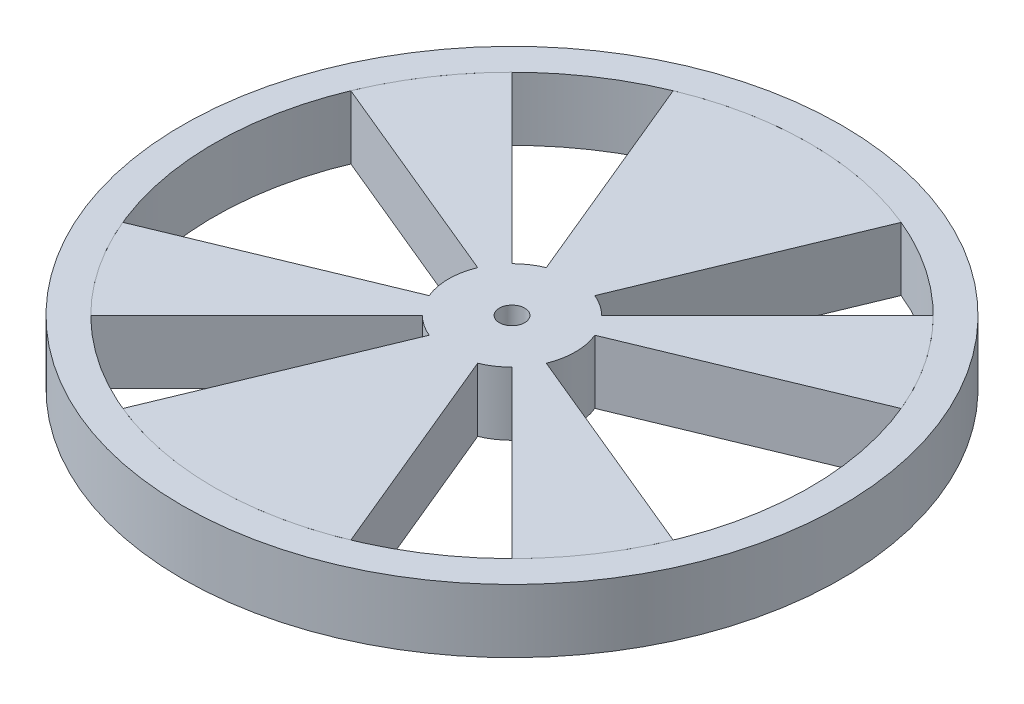
ISO-10303-21;
HEADER;
FILE_DESCRIPTION(('STEP AP214'),'2;1');
FILE_NAME('part.step','',(''),(''),'','','');
FILE_SCHEMA(('AUTOMOTIVE_DESIGN { 1 0 10303 214 1 1 1 1 }'));
ENDSEC;
DATA;
#1=APPLICATION_CONTEXT('core data for automotive mechanical design processes');
#2=APPLICATION_PROTOCOL_DEFINITION('international standard','automotive_design',2000,#1);
#3=PRODUCT_CONTEXT('',#1,'mechanical');
#4=PRODUCT('Part','Part','',(#3));
#5=PRODUCT_RELATED_PRODUCT_CATEGORY('part','',(#4));
#6=PRODUCT_DEFINITION_FORMATION('','',#4);
#7=PRODUCT_DEFINITION_CONTEXT('part definition',#1,'design');
#8=PRODUCT_DEFINITION('design','',#6,#7);
#9=PRODUCT_DEFINITION_SHAPE('','',#8);
#10=(LENGTH_UNIT() NAMED_UNIT(*) SI_UNIT(.MILLI.,.METRE.));
#11=(NAMED_UNIT(*) PLANE_ANGLE_UNIT() SI_UNIT($,.RADIAN.));
#12=(NAMED_UNIT(*) SI_UNIT($,.STERADIAN.) SOLID_ANGLE_UNIT());
#13=UNCERTAINTY_MEASURE_WITH_UNIT(LENGTH_MEASURE(1.E-05),#10,'distance_accuracy_value','');
#14=(GEOMETRIC_REPRESENTATION_CONTEXT(3) GLOBAL_UNCERTAINTY_ASSIGNED_CONTEXT((#13)) GLOBAL_UNIT_ASSIGNED_CONTEXT((#10,
#11,#12)) REPRESENTATION_CONTEXT('',''));
#15=CARTESIAN_POINT('',(0.,0.,0.));
#16=DIRECTION('',(0.,0.,1.));
#17=DIRECTION('',(1.,0.,0.));
#18=AXIS2_PLACEMENT_3D('',#15,#16,#17);
#19=CARTESIAN_POINT('',(0.,0.,0.));
#20=DIRECTION('',(0.,1.,0.));
#21=DIRECTION('',(0.,0.,1.));
#22=AXIS2_PLACEMENT_3D('',#19,#20,#21);
#23=CYLINDRICAL_SURFACE('',#22,23.5);
#24=CARTESIAN_POINT('',(0.,5.,0.));
#25=DIRECTION('',(0.,1.,0.));
#26=DIRECTION('',(0.,0.,1.));
#27=AXIS2_PLACEMENT_3D('',#24,#25,#26);
#28=CIRCLE('',#27,23.5);
#29=CARTESIAN_POINT('',(8.99306066057963,5.,-21.7111690140152));
#30=VERTEX_POINT('',#29);
#31=CARTESIAN_POINT('',(-8.99306066057962,5.,-21.7111690140152));
#32=VERTEX_POINT('',#31);
#33=EDGE_CURVE('E293',#30,#32,#28,.T.);
#34=ORIENTED_EDGE('',*,*,#33,.F.);
#35=DIRECTION('',(0.,1.,0.));
#36=VECTOR('',#35,1.);
#37=CARTESIAN_POINT('',(8.99306066057963,0.,-21.7111690140152));
#38=LINE('',#37,#36);
#39=CARTESIAN_POINT('',(8.99306066057963,0.,-21.7111690140152));
#40=VERTEX_POINT('',#39);
#41=EDGE_CURVE('E12',#40,#30,#38,.T.);
#42=ORIENTED_EDGE('',*,*,#41,.F.);
#43=CARTESIAN_POINT('',(0.,0.,0.));
#44=DIRECTION('',(0.,1.,0.));
#45=DIRECTION('',(0.,0.,1.));
#46=AXIS2_PLACEMENT_3D('',#43,#44,#45);
#47=CIRCLE('',#46,23.5);
#48=CARTESIAN_POINT('',(-8.99306066057962,0.,-21.7111690140152));
#49=VERTEX_POINT('',#48);
#50=EDGE_CURVE('E250',#40,#49,#47,.T.);
#51=ORIENTED_EDGE('',*,*,#50,.T.);
#52=DIRECTION('',(0.,1.,0.));
#53=VECTOR('',#52,1.);
#54=CARTESIAN_POINT('',(-8.99306066057962,0.,-21.7111690140152));
#55=LINE('',#54,#53);
#56=EDGE_CURVE('E48',#49,#32,#55,.T.);
#57=ORIENTED_EDGE('',*,*,#56,.T.);
#58=EDGE_LOOP('',(#34,#42,#51,#57));
#59=FACE_BOUND('',#58,.T.);
#60=ADVANCED_FACE('F45',(#59),#23,.T.);
#61=CARTESIAN_POINT('',(0.,0.,0.));
#62=DIRECTION('',(0.923879532511287,0.,0.382683432365091));
#63=DIRECTION('',(0.382683432365091,0.,-0.923879532511287));
#64=AXIS2_PLACEMENT_3D('',#61,#62,#63);
#65=PLANE('',#64);
#66=DIRECTION('',(0.382683432365091,0.,-0.923879532511287));
#67=VECTOR('',#66,1.);
#68=CARTESIAN_POINT('',(0.,5.,0.));
#69=LINE('',#68,#67);
#70=CARTESIAN_POINT('',(1.91341716182545,5.,-4.61939766255643));
#71=VERTEX_POINT('',#70);
#72=EDGE_CURVE('E350',#71,#30,#69,.T.);
#73=ORIENTED_EDGE('',*,*,#72,.F.);
#74=DIRECTION('',(0.,1.,0.));
#75=VECTOR('',#74,1.);
#76=CARTESIAN_POINT('',(1.91341716182545,0.,-4.61939766255643));
#77=LINE('',#76,#75);
#78=CARTESIAN_POINT('',(1.91341716182545,0.,-4.61939766255643));
#79=VERTEX_POINT('',#78);
#80=EDGE_CURVE('E54',#79,#71,#77,.T.);
#81=ORIENTED_EDGE('',*,*,#80,.F.);
#82=DIRECTION('',(0.382683432365091,0.,-0.923879532511287));
#83=VECTOR('',#82,1.);
#84=CARTESIAN_POINT('',(0.,0.,0.));
#85=LINE('',#84,#83);
#86=EDGE_CURVE('E232',#79,#40,#85,.T.);
#87=ORIENTED_EDGE('',*,*,#86,.T.);
#88=ORIENTED_EDGE('',*,*,#41,.T.);
#89=EDGE_LOOP('',(#73,#81,#87,#88));
#90=FACE_BOUND('',#89,.T.);
#91=ADVANCED_FACE('F401',(#90),#65,.T.);
#92=CARTESIAN_POINT('',(0.,0.,0.));
#93=DIRECTION('',(0.,1.,0.));
#94=DIRECTION('',(0.,0.,1.));
#95=AXIS2_PLACEMENT_3D('',#92,#93,#94);
#96=CYLINDRICAL_SURFACE('',#95,5.);
#97=CARTESIAN_POINT('',(0.,5.,0.));
#98=DIRECTION('',(0.,1.,0.));
#99=DIRECTION('',(0.,0.,1.));
#100=AXIS2_PLACEMENT_3D('',#97,#98,#99);
#101=CIRCLE('',#100,5.);
#102=CARTESIAN_POINT('',(3.53553390593273,5.,-3.53553390593274));
#103=VERTEX_POINT('',#102);
#104=EDGE_CURVE('E217',#103,#71,#101,.T.);
#105=ORIENTED_EDGE('',*,*,#104,.F.);
#106=DIRECTION('',(0.,1.,0.));
#107=VECTOR('',#106,1.);
#108=CARTESIAN_POINT('',(3.53553390593273,0.,-3.53553390593274));
#109=LINE('',#108,#107);
#110=CARTESIAN_POINT('',(3.53553390593273,0.,-3.53553390593274));
#111=VERTEX_POINT('',#110);
#112=EDGE_CURVE('E211',#111,#103,#109,.T.);
#113=ORIENTED_EDGE('',*,*,#112,.F.);
#114=CARTESIAN_POINT('',(0.,0.,0.));
#115=DIRECTION('',(0.,1.,0.));
#116=DIRECTION('',(0.,0.,1.));
#117=AXIS2_PLACEMENT_3D('',#114,#115,#116);
#118=CIRCLE('',#117,5.);
#119=EDGE_CURVE('E215',#111,#79,#118,.T.);
#120=ORIENTED_EDGE('',*,*,#119,.T.);
#121=ORIENTED_EDGE('',*,*,#80,.T.);
#122=EDGE_LOOP('',(#105,#113,#120,#121));
#123=FACE_BOUND('',#122,.T.);
#124=ADVANCED_FACE('F213',(#123),#96,.T.);
#125=CARTESIAN_POINT('',(0.,0.,0.));
#126=DIRECTION('',(0.707106781186549,0.,0.707106781186546));
#127=DIRECTION('',(0.707106781186546,0.,-0.707106781186549));
#128=AXIS2_PLACEMENT_3D('',#125,#126,#127);
#129=PLANE('',#128);
#130=DIRECTION('',(0.707106781186546,0.,-0.707106781186549));
#131=VECTOR('',#130,1.);
#132=CARTESIAN_POINT('',(0.,5.,0.));
#133=LINE('',#132,#131);
#134=CARTESIAN_POINT('',(16.6170093578838,5.,-16.6170093578839));
#135=VERTEX_POINT('',#134);
#136=EDGE_CURVE('E348',#103,#135,#133,.T.);
#137=ORIENTED_EDGE('',*,*,#136,.T.);
#138=DIRECTION('',(0.,1.,0.));
#139=VECTOR('',#138,1.);
#140=CARTESIAN_POINT('',(16.6170093578838,0.,-16.6170093578839));
#141=LINE('',#140,#139);
#142=CARTESIAN_POINT('',(16.6170093578838,0.,-16.6170093578839));
#143=VERTEX_POINT('',#142);
#144=EDGE_CURVE('E221',#143,#135,#141,.T.);
#145=ORIENTED_EDGE('',*,*,#144,.F.);
#146=DIRECTION('',(0.707106781186546,0.,-0.707106781186549));
#147=VECTOR('',#146,1.);
#148=CARTESIAN_POINT('',(0.,0.,0.));
#149=LINE('',#148,#147);
#150=EDGE_CURVE('E224',#111,#143,#149,.T.);
#151=ORIENTED_EDGE('',*,*,#150,.F.);
#152=ORIENTED_EDGE('',*,*,#112,.T.);
#153=EDGE_LOOP('',(#137,#145,#151,#152));
#154=FACE_BOUND('',#153,.T.);
#155=ADVANCED_FACE('F225',(#154),#129,.F.);
#156=CARTESIAN_POINT('',(0.,0.,0.));
#157=DIRECTION('',(0.,1.,0.));
#158=DIRECTION('',(0.,0.,1.));
#159=AXIS2_PLACEMENT_3D('',#156,#157,#158);
#160=CYLINDRICAL_SURFACE('',#159,23.5);
#161=CARTESIAN_POINT('',(0.,5.,0.));
#162=DIRECTION('',(0.,1.,0.));
#163=DIRECTION('',(0.,0.,1.));
#164=AXIS2_PLACEMENT_3D('',#161,#162,#163);
#165=CIRCLE('',#164,23.5);
#166=CARTESIAN_POINT('',(21.7111690140152,5.,-8.99306066057963));
#167=VERTEX_POINT('',#166);
#168=EDGE_CURVE('E345',#167,#135,#165,.T.);
#169=ORIENTED_EDGE('',*,*,#168,.F.);
#170=DIRECTION('',(0.,1.,0.));
#171=VECTOR('',#170,1.);
#172=CARTESIAN_POINT('',(21.7111690140152,0.,-8.99306066057963));
#173=LINE('',#172,#171);
#174=CARTESIAN_POINT('',(21.7111690140152,0.,-8.99306066057963));
#175=VERTEX_POINT('',#174);
#176=EDGE_CURVE('E358',#175,#167,#173,.T.);
#177=ORIENTED_EDGE('',*,*,#176,.F.);
#178=CARTESIAN_POINT('',(0.,0.,0.));
#179=DIRECTION('',(0.,1.,0.));
#180=DIRECTION('',(0.,0.,1.));
#181=AXIS2_PLACEMENT_3D('',#178,#179,#180);
#182=CIRCLE('',#181,23.5);
#183=EDGE_CURVE('E228',#175,#143,#182,.T.);
#184=ORIENTED_EDGE('',*,*,#183,.T.);
#185=ORIENTED_EDGE('',*,*,#144,.T.);
#186=EDGE_LOOP('',(#169,#177,#184,#185));
#187=FACE_BOUND('',#186,.T.);
#188=ADVANCED_FACE('F417',(#187),#160,.T.);
#189=CARTESIAN_POINT('',(0.,0.,0.));
#190=DIRECTION('',(0.382683432365091,0.,0.923879532511287));
#191=DIRECTION('',(0.923879532511287,0.,-0.382683432365091));
#192=AXIS2_PLACEMENT_3D('',#189,#190,#191);
#193=PLANE('',#192);
#194=DIRECTION('',(0.923879532511286,0.,-0.382683432365091));
#195=VECTOR('',#194,1.);
#196=CARTESIAN_POINT('',(0.,5.,0.));
#197=LINE('',#196,#195);
#198=CARTESIAN_POINT('',(4.61939766255643,5.,-1.91341716182545));
#199=VERTEX_POINT('',#198);
#200=EDGE_CURVE('E342',#199,#167,#197,.T.);
#201=ORIENTED_EDGE('',*,*,#200,.F.);
#202=DIRECTION('',(0.,1.,0.));
#203=VECTOR('',#202,1.);
#204=CARTESIAN_POINT('',(4.61939766255643,0.,-1.91341716182545));
#205=LINE('',#204,#203);
#206=CARTESIAN_POINT('',(4.61939766255643,0.,-1.91341716182545));
#207=VERTEX_POINT('',#206);
#208=EDGE_CURVE('E360',#207,#199,#205,.T.);
#209=ORIENTED_EDGE('',*,*,#208,.F.);
#210=DIRECTION('',(0.923879532511286,0.,-0.382683432365091));
#211=VECTOR('',#210,1.);
#212=CARTESIAN_POINT('',(0.,0.,0.));
#213=LINE('',#212,#211);
#214=EDGE_CURVE('E241',#207,#175,#213,.T.);
#215=ORIENTED_EDGE('',*,*,#214,.T.);
#216=ORIENTED_EDGE('',*,*,#176,.T.);
#217=EDGE_LOOP('',(#201,#209,#215,#216));
#218=FACE_BOUND('',#217,.T.);
#219=ADVANCED_FACE('F420',(#218),#193,.T.);
#220=CARTESIAN_POINT('',(4.61939766255643,5.,1.91341716182545));
#221=VERTEX_POINT('',#220);
#222=EDGE_CURVE('E341',#221,#199,#101,.T.);
#223=ORIENTED_EDGE('',*,*,#222,.F.);
#224=DIRECTION('',(0.,1.,0.));
#225=VECTOR('',#224,1.);
#226=CARTESIAN_POINT('',(4.61939766255643,0.,1.91341716182545));
#227=LINE('',#226,#225);
#228=CARTESIAN_POINT('',(4.61939766255643,0.,1.91341716182545));
#229=VERTEX_POINT('',#228);
#230=EDGE_CURVE('E362',#229,#221,#227,.T.);
#231=ORIENTED_EDGE('',*,*,#230,.F.);
#232=EDGE_CURVE('E234',#229,#207,#118,.T.);
#233=ORIENTED_EDGE('',*,*,#232,.T.);
#234=ORIENTED_EDGE('',*,*,#208,.T.);
#235=EDGE_LOOP('',(#223,#231,#233,#234));
#236=FACE_BOUND('',#235,.T.);
#237=ADVANCED_FACE('F410',(#236),#96,.T.);
#238=CARTESIAN_POINT('',(0.,0.,0.));
#239=DIRECTION('',(-0.382683432365091,0.,0.923879532511286));
#240=DIRECTION('',(0.923879532511286,0.,0.382683432365091));
#241=AXIS2_PLACEMENT_3D('',#238,#239,#240);
#242=PLANE('',#241);
#243=DIRECTION('',(0.923879532511286,0.,0.382683432365091));
#244=VECTOR('',#243,1.);
#245=CARTESIAN_POINT('',(0.,5.,0.));
#246=LINE('',#245,#244);
#247=CARTESIAN_POINT('',(21.7111690140152,5.,8.99306066057964));
#248=VERTEX_POINT('',#247);
#249=EDGE_CURVE('E338',#221,#248,#246,.T.);
#250=ORIENTED_EDGE('',*,*,#249,.T.);
#251=DIRECTION('',(0.,1.,0.));
#252=VECTOR('',#251,1.);
#253=CARTESIAN_POINT('',(21.7111690140152,0.,8.99306066057964));
#254=LINE('',#253,#252);
#255=CARTESIAN_POINT('',(21.7111690140152,0.,8.99306066057964));
#256=VERTEX_POINT('',#255);
#257=EDGE_CURVE('E364',#256,#248,#254,.T.);
#258=ORIENTED_EDGE('',*,*,#257,.F.);
#259=DIRECTION('',(0.923879532511286,0.,0.382683432365091));
#260=VECTOR('',#259,1.);
#261=CARTESIAN_POINT('',(0.,0.,0.));
#262=LINE('',#261,#260);
#263=EDGE_CURVE('E242',#229,#256,#262,.T.);
#264=ORIENTED_EDGE('',*,*,#263,.F.);
#265=ORIENTED_EDGE('',*,*,#230,.T.);
#266=EDGE_LOOP('',(#250,#258,#264,#265));
#267=FACE_BOUND('',#266,.T.);
#268=ADVANCED_FACE('F425',(#267),#242,.F.);
#269=CARTESIAN_POINT('',(0.,0.,0.));
#270=DIRECTION('',(0.,1.,0.));
#271=DIRECTION('',(0.,0.,1.));
#272=AXIS2_PLACEMENT_3D('',#269,#270,#271);
#273=CYLINDRICAL_SURFACE('',#272,23.5);
#274=CARTESIAN_POINT('',(0.,5.,0.));
#275=DIRECTION('',(0.,1.,0.));
#276=DIRECTION('',(0.,0.,1.));
#277=AXIS2_PLACEMENT_3D('',#274,#275,#276);
#278=CIRCLE('',#277,23.5);
#279=CARTESIAN_POINT('',(16.6170093578839,5.,16.6170093578839));
#280=VERTEX_POINT('',#279);
#281=EDGE_CURVE('E335',#280,#248,#278,.T.);
#282=ORIENTED_EDGE('',*,*,#281,.F.);
#283=DIRECTION('',(0.,1.,0.));
#284=VECTOR('',#283,1.);
#285=CARTESIAN_POINT('',(16.6170093578839,0.,16.6170093578839));
#286=LINE('',#285,#284);
#287=CARTESIAN_POINT('',(16.6170093578839,0.,16.6170093578839));
#288=VERTEX_POINT('',#287);
#289=EDGE_CURVE('E366',#288,#280,#286,.T.);
#290=ORIENTED_EDGE('',*,*,#289,.F.);
#291=CARTESIAN_POINT('',(0.,0.,0.));
#292=DIRECTION('',(0.,1.,0.));
#293=DIRECTION('',(0.,0.,1.));
#294=AXIS2_PLACEMENT_3D('',#291,#292,#293);
#295=CIRCLE('',#294,23.5);
#296=EDGE_CURVE('E276',#288,#256,#295,.T.);
#297=ORIENTED_EDGE('',*,*,#296,.T.);
#298=ORIENTED_EDGE('',*,*,#257,.T.);
#299=EDGE_LOOP('',(#282,#290,#297,#298));
#300=FACE_BOUND('',#299,.T.);
#301=ADVANCED_FACE('F428',(#300),#273,.T.);
#302=CARTESIAN_POINT('',(0.,0.,0.));
#303=DIRECTION('',(-0.707106781186548,0.,0.707106781186548));
#304=DIRECTION('',(0.707106781186548,0.,0.707106781186548));
#305=AXIS2_PLACEMENT_3D('',#302,#303,#304);
#306=PLANE('',#305);
#307=DIRECTION('',(0.707106781186548,0.,0.707106781186548));
#308=VECTOR('',#307,1.);
#309=CARTESIAN_POINT('',(0.,5.,0.));
#310=LINE('',#309,#308);
#311=CARTESIAN_POINT('',(3.53553390593274,5.,3.53553390593274));
#312=VERTEX_POINT('',#311);
#313=EDGE_CURVE('E332',#312,#280,#310,.T.);
#314=ORIENTED_EDGE('',*,*,#313,.F.);
#315=DIRECTION('',(0.,1.,0.));
#316=VECTOR('',#315,1.);
#317=CARTESIAN_POINT('',(3.53553390593274,0.,3.53553390593274));
#318=LINE('',#317,#316);
#319=CARTESIAN_POINT('',(3.53553390593274,0.,3.53553390593274));
#320=VERTEX_POINT('',#319);
#321=EDGE_CURVE('E368',#320,#312,#318,.T.);
#322=ORIENTED_EDGE('',*,*,#321,.F.);
#323=DIRECTION('',(0.707106781186548,0.,0.707106781186548));
#324=VECTOR('',#323,1.);
#325=CARTESIAN_POINT('',(0.,0.,0.));
#326=LINE('',#325,#324);
#327=EDGE_CURVE('E271',#320,#288,#326,.T.);
#328=ORIENTED_EDGE('',*,*,#327,.T.);
#329=ORIENTED_EDGE('',*,*,#289,.T.);
#330=EDGE_LOOP('',(#314,#322,#328,#329));
#331=FACE_BOUND('',#330,.T.);
#332=ADVANCED_FACE('F432',(#331),#306,.T.);
#333=CARTESIAN_POINT('',(1.91341716182545,5.,4.61939766255643));
#334=VERTEX_POINT('',#333);
#335=EDGE_CURVE('E331',#334,#312,#101,.T.);
#336=ORIENTED_EDGE('',*,*,#335,.F.);
#337=DIRECTION('',(0.,1.,0.));
#338=VECTOR('',#337,1.);
#339=CARTESIAN_POINT('',(1.91341716182545,0.,4.61939766255643));
#340=LINE('',#339,#338);
#341=CARTESIAN_POINT('',(1.91341716182545,0.,4.61939766255643));
#342=VERTEX_POINT('',#341);
#343=EDGE_CURVE('E370',#342,#334,#340,.T.);
#344=ORIENTED_EDGE('',*,*,#343,.F.);
#345=EDGE_CURVE('E243',#342,#320,#118,.T.);
#346=ORIENTED_EDGE('',*,*,#345,.T.);
#347=ORIENTED_EDGE('',*,*,#321,.T.);
#348=EDGE_LOOP('',(#336,#344,#346,#347));
#349=FACE_BOUND('',#348,.T.);
#350=ADVANCED_FACE('F436',(#349),#96,.T.);
#351=CARTESIAN_POINT('',(0.,0.,0.));
#352=DIRECTION('',(-0.923879532511287,0.,0.382683432365091));
#353=DIRECTION('',(0.382683432365091,0.,0.923879532511287));
#354=AXIS2_PLACEMENT_3D('',#351,#352,#353);
#355=PLANE('',#354);
#356=DIRECTION('',(0.382683432365091,0.,0.923879532511287));
#357=VECTOR('',#356,1.);
#358=CARTESIAN_POINT('',(0.,5.,0.));
#359=LINE('',#358,#357);
#360=CARTESIAN_POINT('',(8.99306066057963,5.,21.7111690140152));
#361=VERTEX_POINT('',#360);
#362=EDGE_CURVE('E328',#334,#361,#359,.T.);
#363=ORIENTED_EDGE('',*,*,#362,.T.);
#364=DIRECTION('',(0.,1.,0.));
#365=VECTOR('',#364,1.);
#366=CARTESIAN_POINT('',(8.99306066057963,0.,21.7111690140152));
#367=LINE('',#366,#365);
#368=CARTESIAN_POINT('',(8.99306066057963,0.,21.7111690140152));
#369=VERTEX_POINT('',#368);
#370=EDGE_CURVE('E372',#369,#361,#367,.T.);
#371=ORIENTED_EDGE('',*,*,#370,.F.);
#372=DIRECTION('',(0.382683432365091,0.,0.923879532511287));
#373=VECTOR('',#372,1.);
#374=CARTESIAN_POINT('',(0.,0.,0.));
#375=LINE('',#374,#373);
#376=EDGE_CURVE('E272',#342,#369,#375,.T.);
#377=ORIENTED_EDGE('',*,*,#376,.F.);
#378=ORIENTED_EDGE('',*,*,#343,.T.);
#379=EDGE_LOOP('',(#363,#371,#377,#378));
#380=FACE_BOUND('',#379,.T.);
#381=ADVANCED_FACE('F438',(#380),#355,.F.);
#382=CARTESIAN_POINT('',(0.,0.,0.));
#383=DIRECTION('',(0.,1.,0.));
#384=DIRECTION('',(0.,0.,1.));
#385=AXIS2_PLACEMENT_3D('',#382,#383,#384);
#386=CYLINDRICAL_SURFACE('',#385,23.5);
#387=CARTESIAN_POINT('',(0.,5.,0.));
#388=DIRECTION('',(0.,1.,0.));
#389=DIRECTION('',(0.,0.,1.));
#390=AXIS2_PLACEMENT_3D('',#387,#388,#389);
#391=CIRCLE('',#390,23.5);
#392=CARTESIAN_POINT('',(-8.99306066057963,5.,21.7111690140152));
#393=VERTEX_POINT('',#392);
#394=EDGE_CURVE('E325',#393,#361,#391,.T.);
#395=ORIENTED_EDGE('',*,*,#394,.F.);
#396=DIRECTION('',(0.,1.,0.));
#397=VECTOR('',#396,1.);
#398=CARTESIAN_POINT('',(-8.99306066057963,0.,21.7111690140152));
#399=LINE('',#398,#397);
#400=CARTESIAN_POINT('',(-8.99306066057963,0.,21.7111690140152));
#401=VERTEX_POINT('',#400);
#402=EDGE_CURVE('E374',#401,#393,#399,.T.);
#403=ORIENTED_EDGE('',*,*,#402,.F.);
#404=CARTESIAN_POINT('',(0.,0.,0.));
#405=DIRECTION('',(0.,1.,0.));
#406=DIRECTION('',(0.,0.,1.));
#407=AXIS2_PLACEMENT_3D('',#404,#405,#406);
#408=CIRCLE('',#407,23.5);
#409=EDGE_CURVE('E267',#401,#369,#408,.T.);
#410=ORIENTED_EDGE('',*,*,#409,.T.);
#411=ORIENTED_EDGE('',*,*,#370,.T.);
#412=EDGE_LOOP('',(#395,#403,#410,#411));
#413=FACE_BOUND('',#412,.T.);
#414=ADVANCED_FACE('F441',(#413),#386,.T.);
#415=CARTESIAN_POINT('',(0.,0.,0.));
#416=DIRECTION('',(-0.923879532511287,0.,-0.382683432365091));
#417=DIRECTION('',(-0.382683432365091,0.,0.923879532511287));
#418=AXIS2_PLACEMENT_3D('',#415,#416,#417);
#419=PLANE('',#418);
#420=DIRECTION('',(-0.382683432365091,0.,0.923879532511287));
#421=VECTOR('',#420,1.);
#422=CARTESIAN_POINT('',(0.,5.,0.));
#423=LINE('',#422,#421);
#424=CARTESIAN_POINT('',(-1.91341716182545,5.,4.61939766255643));
#425=VERTEX_POINT('',#424);
#426=EDGE_CURVE('E322',#425,#393,#423,.T.);
#427=ORIENTED_EDGE('',*,*,#426,.F.);
#428=DIRECTION('',(0.,1.,0.));
#429=VECTOR('',#428,1.);
#430=CARTESIAN_POINT('',(-1.91341716182545,0.,4.61939766255643));
#431=LINE('',#430,#429);
#432=CARTESIAN_POINT('',(-1.91341716182545,0.,4.61939766255643));
#433=VERTEX_POINT('',#432);
#434=EDGE_CURVE('E376',#433,#425,#431,.T.);
#435=ORIENTED_EDGE('',*,*,#434,.F.);
#436=DIRECTION('',(-0.382683432365091,0.,0.923879532511287));
#437=VECTOR('',#436,1.);
#438=CARTESIAN_POINT('',(0.,0.,0.));
#439=LINE('',#438,#437);
#440=EDGE_CURVE('E262',#433,#401,#439,.T.);
#441=ORIENTED_EDGE('',*,*,#440,.T.);
#442=ORIENTED_EDGE('',*,*,#402,.T.);
#443=EDGE_LOOP('',(#427,#435,#441,#442));
#444=FACE_BOUND('',#443,.T.);
#445=ADVANCED_FACE('F445',(#444),#419,.T.);
#446=CARTESIAN_POINT('',(-3.53553390593274,5.,3.53553390593274));
#447=VERTEX_POINT('',#446);
#448=EDGE_CURVE('E321',#447,#425,#101,.T.);
#449=ORIENTED_EDGE('',*,*,#448,.F.);
#450=DIRECTION('',(0.,1.,0.));
#451=VECTOR('',#450,1.);
#452=CARTESIAN_POINT('',(-3.53553390593274,0.,3.53553390593274));
#453=LINE('',#452,#451);
#454=CARTESIAN_POINT('',(-3.53553390593274,0.,3.53553390593274));
#455=VERTEX_POINT('',#454);
#456=EDGE_CURVE('E378',#455,#447,#453,.T.);
#457=ORIENTED_EDGE('',*,*,#456,.F.);
#458=EDGE_CURVE('E254',#455,#433,#118,.T.);
#459=ORIENTED_EDGE('',*,*,#458,.T.);
#460=ORIENTED_EDGE('',*,*,#434,.T.);
#461=EDGE_LOOP('',(#449,#457,#459,#460));
#462=FACE_BOUND('',#461,.T.);
#463=ADVANCED_FACE('F449',(#462),#96,.T.);
#464=CARTESIAN_POINT('',(0.,0.,0.));
#465=DIRECTION('',(-0.707106781186548,0.,-0.707106781186548));
#466=DIRECTION('',(-0.707106781186548,0.,0.707106781186548));
#467=AXIS2_PLACEMENT_3D('',#464,#465,#466);
#468=PLANE('',#467);
#469=DIRECTION('',(-0.707106781186548,0.,0.707106781186548));
#470=VECTOR('',#469,1.);
#471=CARTESIAN_POINT('',(0.,5.,0.));
#472=LINE('',#471,#470);
#473=CARTESIAN_POINT('',(-16.6170093578839,5.,16.6170093578839));
#474=VERTEX_POINT('',#473);
#475=EDGE_CURVE('E318',#447,#474,#472,.T.);
#476=ORIENTED_EDGE('',*,*,#475,.T.);
#477=DIRECTION('',(0.,1.,0.));
#478=VECTOR('',#477,1.);
#479=CARTESIAN_POINT('',(-16.6170093578839,0.,16.6170093578839));
#480=LINE('',#479,#478);
#481=CARTESIAN_POINT('',(-16.6170093578839,0.,16.6170093578839));
#482=VERTEX_POINT('',#481);
#483=EDGE_CURVE('E380',#482,#474,#480,.T.);
#484=ORIENTED_EDGE('',*,*,#483,.F.);
#485=DIRECTION('',(-0.707106781186548,0.,0.707106781186548));
#486=VECTOR('',#485,1.);
#487=CARTESIAN_POINT('',(0.,0.,0.));
#488=LINE('',#487,#486);
#489=EDGE_CURVE('E263',#455,#482,#488,.T.);
#490=ORIENTED_EDGE('',*,*,#489,.F.);
#491=ORIENTED_EDGE('',*,*,#456,.T.);
#492=EDGE_LOOP('',(#476,#484,#490,#491));
#493=FACE_BOUND('',#492,.T.);
#494=ADVANCED_FACE('F451',(#493),#468,.F.);
#495=CARTESIAN_POINT('',(0.,0.,0.));
#496=DIRECTION('',(0.,1.,0.));
#497=DIRECTION('',(0.,0.,1.));
#498=AXIS2_PLACEMENT_3D('',#495,#496,#497);
#499=CYLINDRICAL_SURFACE('',#498,23.5);
#500=CARTESIAN_POINT('',(0.,5.,0.));
#501=DIRECTION('',(0.,1.,0.));
#502=DIRECTION('',(0.,0.,1.));
#503=AXIS2_PLACEMENT_3D('',#500,#501,#502);
#504=CIRCLE('',#503,23.5);
#505=CARTESIAN_POINT('',(-21.7111690140153,5.,8.99306066057955));
#506=VERTEX_POINT('',#505);
#507=EDGE_CURVE('E315',#506,#474,#504,.T.);
#508=ORIENTED_EDGE('',*,*,#507,.F.);
#509=DIRECTION('',(0.,1.,0.));
#510=VECTOR('',#509,1.);
#511=CARTESIAN_POINT('',(-21.7111690140153,0.,8.99306066057955));
#512=LINE('',#511,#510);
#513=CARTESIAN_POINT('',(-21.7111690140153,0.,8.99306066057955));
#514=VERTEX_POINT('',#513);
#515=EDGE_CURVE('E382',#514,#506,#512,.T.);
#516=ORIENTED_EDGE('',*,*,#515,.F.);
#517=CARTESIAN_POINT('',(0.,0.,0.));
#518=DIRECTION('',(0.,1.,0.));
#519=DIRECTION('',(0.,0.,1.));
#520=AXIS2_PLACEMENT_3D('',#517,#518,#519);
#521=CIRCLE('',#520,23.5);
#522=EDGE_CURVE('E258',#514,#482,#521,.T.);
#523=ORIENTED_EDGE('',*,*,#522,.T.);
#524=ORIENTED_EDGE('',*,*,#483,.T.);
#525=EDGE_LOOP('',(#508,#516,#523,#524));
#526=FACE_BOUND('',#525,.T.);
#527=ADVANCED_FACE('F454',(#526),#499,.T.);
#528=CARTESIAN_POINT('',(0.,0.,0.));
#529=DIRECTION('',(-0.382683432365087,0.,-0.923879532511288));
#530=DIRECTION('',(-0.923879532511288,0.,0.382683432365087));
#531=AXIS2_PLACEMENT_3D('',#528,#529,#530);
#532=PLANE('',#531);
#533=DIRECTION('',(-0.923879532511288,0.,0.382683432365087));
#534=VECTOR('',#533,1.);
#535=CARTESIAN_POINT('',(0.,5.,0.));
#536=LINE('',#535,#534);
#537=CARTESIAN_POINT('',(-4.61939766255644,5.,1.91341716182544));
#538=VERTEX_POINT('',#537);
#539=EDGE_CURVE('E312',#538,#506,#536,.T.);
#540=ORIENTED_EDGE('',*,*,#539,.F.);
#541=DIRECTION('',(0.,1.,0.));
#542=VECTOR('',#541,1.);
#543=CARTESIAN_POINT('',(-4.61939766255644,0.,1.91341716182544));
#544=LINE('',#543,#542);
#545=CARTESIAN_POINT('',(-4.61939766255644,0.,1.91341716182544));
#546=VERTEX_POINT('',#545);
#547=EDGE_CURVE('E384',#546,#538,#544,.T.);
#548=ORIENTED_EDGE('',*,*,#547,.F.);
#549=DIRECTION('',(-0.923879532511288,0.,0.382683432365087));
#550=VECTOR('',#549,1.);
#551=CARTESIAN_POINT('',(0.,0.,0.));
#552=LINE('',#551,#550);
#553=EDGE_CURVE('E252',#546,#514,#552,.T.);
#554=ORIENTED_EDGE('',*,*,#553,.T.);
#555=ORIENTED_EDGE('',*,*,#515,.T.);
#556=EDGE_LOOP('',(#540,#548,#554,#555));
#557=FACE_BOUND('',#556,.T.);
#558=ADVANCED_FACE('F458',(#557),#532,.T.);
#559=CARTESIAN_POINT('',(-4.61939766255644,5.,-1.91341716182544));
#560=VERTEX_POINT('',#559);
#561=EDGE_CURVE('E303',#560,#538,#101,.T.);
#562=ORIENTED_EDGE('',*,*,#561,.F.);
#563=DIRECTION('',(0.,1.,0.));
#564=VECTOR('',#563,1.);
#565=CARTESIAN_POINT('',(-4.61939766255644,0.,-1.91341716182544));
#566=LINE('',#565,#564);
#567=CARTESIAN_POINT('',(-4.61939766255644,0.,-1.91341716182544));
#568=VERTEX_POINT('',#567);
#569=EDGE_CURVE('E386',#568,#560,#566,.T.);
#570=ORIENTED_EDGE('',*,*,#569,.F.);
#571=EDGE_CURVE('E246',#568,#546,#118,.T.);
#572=ORIENTED_EDGE('',*,*,#571,.T.);
#573=ORIENTED_EDGE('',*,*,#547,.T.);
#574=EDGE_LOOP('',(#562,#570,#572,#573));
#575=FACE_BOUND('',#574,.T.);
#576=ADVANCED_FACE('F462',(#575),#96,.T.);
#577=CARTESIAN_POINT('',(0.,0.,0.));
#578=DIRECTION('',(0.382683432365087,0.,-0.923879532511288));
#579=DIRECTION('',(-0.923879532511288,0.,-0.382683432365087));
#580=AXIS2_PLACEMENT_3D('',#577,#578,#579);
#581=PLANE('',#580);
#582=DIRECTION('',(-0.923879532511288,0.,-0.382683432365087));
#583=VECTOR('',#582,1.);
#584=CARTESIAN_POINT('',(0.,5.,0.));
#585=LINE('',#584,#583);
#586=CARTESIAN_POINT('',(-21.7111690140153,5.,-8.99306066057956));
#587=VERTEX_POINT('',#586);
#588=EDGE_CURVE('E309',#560,#587,#585,.T.);
#589=ORIENTED_EDGE('',*,*,#588,.T.);
#590=DIRECTION('',(0.,1.,0.));
#591=VECTOR('',#590,1.);
#592=CARTESIAN_POINT('',(-21.7111690140153,0.,-8.99306066057956));
#593=LINE('',#592,#591);
#594=CARTESIAN_POINT('',(-21.7111690140153,0.,-8.99306066057956));
#595=VERTEX_POINT('',#594);
#596=EDGE_CURVE('E388',#595,#587,#593,.T.);
#597=ORIENTED_EDGE('',*,*,#596,.F.);
#598=DIRECTION('',(-0.923879532511288,0.,-0.382683432365087));
#599=VECTOR('',#598,1.);
#600=CARTESIAN_POINT('',(0.,0.,0.));
#601=LINE('',#600,#599);
#602=EDGE_CURVE('E253',#568,#595,#601,.T.);
#603=ORIENTED_EDGE('',*,*,#602,.F.);
#604=ORIENTED_EDGE('',*,*,#569,.T.);
#605=EDGE_LOOP('',(#589,#597,#603,#604));
#606=FACE_BOUND('',#605,.T.);
#607=ADVANCED_FACE('F464',(#606),#581,.F.);
#608=CARTESIAN_POINT('',(0.,0.,0.));
#609=DIRECTION('',(0.,1.,0.));
#610=DIRECTION('',(0.,0.,1.));
#611=AXIS2_PLACEMENT_3D('',#608,#609,#610);
#612=CYLINDRICAL_SURFACE('',#611,23.5);
#613=CARTESIAN_POINT('',(0.,5.,0.));
#614=DIRECTION('',(0.,1.,0.));
#615=DIRECTION('',(0.,0.,1.));
#616=AXIS2_PLACEMENT_3D('',#613,#614,#615);
#617=CIRCLE('',#616,23.5);
#618=CARTESIAN_POINT('',(-16.6170093578839,5.,-16.6170093578838));
#619=VERTEX_POINT('',#618);
#620=EDGE_CURVE('E306',#619,#587,#617,.T.);
#621=ORIENTED_EDGE('',*,*,#620,.F.);
#622=DIRECTION('',(0.,1.,0.));
#623=VECTOR('',#622,1.);
#624=CARTESIAN_POINT('',(-16.6170093578839,0.,-16.6170093578838));
#625=LINE('',#624,#623);
#626=CARTESIAN_POINT('',(-16.6170093578839,0.,-16.6170093578838));
#627=VERTEX_POINT('',#626);
#628=EDGE_CURVE('E390',#627,#619,#625,.T.);
#629=ORIENTED_EDGE('',*,*,#628,.F.);
#630=CARTESIAN_POINT('',(0.,0.,0.));
#631=DIRECTION('',(0.,1.,0.));
#632=DIRECTION('',(0.,0.,1.));
#633=AXIS2_PLACEMENT_3D('',#630,#631,#632);
#634=CIRCLE('',#633,23.5);
#635=EDGE_CURVE('E249',#627,#595,#634,.T.);
#636=ORIENTED_EDGE('',*,*,#635,.T.);
#637=ORIENTED_EDGE('',*,*,#596,.T.);
#638=EDGE_LOOP('',(#621,#629,#636,#637));
#639=FACE_BOUND('',#638,.T.);
#640=ADVANCED_FACE('F467',(#639),#612,.T.);
#641=CARTESIAN_POINT('',(0.,0.,0.));
#642=DIRECTION('',(0.707106781186546,0.,-0.707106781186549));
#643=DIRECTION('',(-0.707106781186549,0.,-0.707106781186546));
#644=AXIS2_PLACEMENT_3D('',#641,#642,#643);
#645=PLANE('',#644);
#646=DIRECTION('',(-0.707106781186549,0.,-0.707106781186546));
#647=VECTOR('',#646,1.);
#648=CARTESIAN_POINT('',(0.,5.,0.));
#649=LINE('',#648,#647);
#650=CARTESIAN_POINT('',(-3.53553390593274,5.,-3.53553390593273));
#651=VERTEX_POINT('',#650);
#652=EDGE_CURVE('E302',#651,#619,#649,.T.);
#653=ORIENTED_EDGE('',*,*,#652,.F.);
#654=DIRECTION('',(0.,1.,0.));
#655=VECTOR('',#654,1.);
#656=CARTESIAN_POINT('',(-3.53553390593274,0.,-3.53553390593273));
#657=LINE('',#656,#655);
#658=CARTESIAN_POINT('',(-3.53553390593274,0.,-3.53553390593273));
#659=VERTEX_POINT('',#658);
#660=EDGE_CURVE('E392',#659,#651,#657,.T.);
#661=ORIENTED_EDGE('',*,*,#660,.F.);
#662=DIRECTION('',(-0.707106781186549,0.,-0.707106781186546));
#663=VECTOR('',#662,1.);
#664=CARTESIAN_POINT('',(0.,0.,0.));
#665=LINE('',#664,#663);
#666=EDGE_CURVE('E245',#659,#627,#665,.T.);
#667=ORIENTED_EDGE('',*,*,#666,.T.);
#668=ORIENTED_EDGE('',*,*,#628,.T.);
#669=EDGE_LOOP('',(#653,#661,#667,#668));
#670=FACE_BOUND('',#669,.T.);
#671=ADVANCED_FACE('F471',(#670),#645,.T.);
#672=CARTESIAN_POINT('',(-1.91341716182545,5.,-4.61939766255643));
#673=VERTEX_POINT('',#672);
#674=EDGE_CURVE('E299',#673,#651,#101,.T.);
#675=ORIENTED_EDGE('',*,*,#674,.F.);
#676=DIRECTION('',(0.,1.,0.));
#677=VECTOR('',#676,1.);
#678=CARTESIAN_POINT('',(-1.91341716182545,0.,-4.61939766255643));
#679=LINE('',#678,#677);
#680=CARTESIAN_POINT('',(-1.91341716182545,0.,-4.61939766255643));
#681=VERTEX_POINT('',#680);
#682=EDGE_CURVE('E393',#681,#673,#679,.T.);
#683=ORIENTED_EDGE('',*,*,#682,.F.);
#684=EDGE_CURVE('E235',#681,#659,#118,.T.);
#685=ORIENTED_EDGE('',*,*,#684,.T.);
#686=ORIENTED_EDGE('',*,*,#660,.T.);
#687=EDGE_LOOP('',(#675,#683,#685,#686));
#688=FACE_BOUND('',#687,.T.);
#689=ADVANCED_FACE('F409',(#688),#96,.T.);
#690=CARTESIAN_POINT('',(0.,0.,0.));
#691=DIRECTION('',(0.923879532511287,0.,-0.38268343236509));
#692=DIRECTION('',(-0.38268343236509,0.,-0.923879532511287));
#693=AXIS2_PLACEMENT_3D('',#690,#691,#692);
#694=PLANE('',#693);
#695=DIRECTION('',(-0.38268343236509,0.,-0.923879532511287));
#696=VECTOR('',#695,1.);
#697=CARTESIAN_POINT('',(0.,5.,0.));
#698=LINE('',#697,#696);
#699=EDGE_CURVE('E296',#673,#32,#698,.T.);
#700=ORIENTED_EDGE('',*,*,#699,.T.);
#701=ORIENTED_EDGE('',*,*,#56,.F.);
#702=DIRECTION('',(-0.38268343236509,0.,-0.923879532511287));
#703=VECTOR('',#702,1.);
#704=CARTESIAN_POINT('',(0.,0.,0.));
#705=LINE('',#704,#703);
#706=EDGE_CURVE('E149',#681,#49,#705,.T.);
#707=ORIENTED_EDGE('',*,*,#706,.F.);
#708=ORIENTED_EDGE('',*,*,#682,.T.);
#709=EDGE_LOOP('',(#700,#701,#707,#708));
#710=FACE_BOUND('',#709,.T.);
#711=ADVANCED_FACE('F396',(#710),#694,.F.);
#712=CARTESIAN_POINT('',(0.,0.,0.));
#713=DIRECTION('',(0.,1.,0.));
#714=DIRECTION('',(0.,0.,1.));
#715=AXIS2_PLACEMENT_3D('',#712,#713,#714);
#716=CYLINDRICAL_SURFACE('',#715,1.);
#717=CARTESIAN_POINT('',(0.,0.,0.));
#718=DIRECTION('',(0.,1.,0.));
#719=DIRECTION('',(0.,0.,1.));
#720=AXIS2_PLACEMENT_3D('',#717,#718,#719);
#721=CIRCLE('',#720,1.);
#722=CARTESIAN_POINT('',(0.,0.,1.));
#723=VERTEX_POINT('',#722);
#724=EDGE_CURVE('E236',#723,#723,#721,.T.);
#725=ORIENTED_EDGE('',*,*,#724,.F.);
#726=EDGE_LOOP('',(#725));
#727=FACE_BOUND('',#726,.T.);
#728=CARTESIAN_POINT('',(0.,5.,0.));
#729=DIRECTION('',(0.,1.,0.));
#730=DIRECTION('',(0.,0.,1.));
#731=AXIS2_PLACEMENT_3D('',#728,#729,#730);
#732=CIRCLE('',#731,1.);
#733=CARTESIAN_POINT('',(0.,5.,1.));
#734=VERTEX_POINT('',#733);
#735=EDGE_CURVE('E353',#734,#734,#732,.T.);
#736=ORIENTED_EDGE('',*,*,#735,.T.);
#737=EDGE_LOOP('',(#736));
#738=FACE_BOUND('',#737,.T.);
#739=ADVANCED_FACE('F412',(#727,#738),#716,.F.);
#740=CARTESIAN_POINT('',(0.,0.,0.));
#741=DIRECTION('',(0.,1.,0.));
#742=DIRECTION('',(0.,0.,1.));
#743=AXIS2_PLACEMENT_3D('',#740,#741,#742);
#744=PLANE('',#743);
#745=ORIENTED_EDGE('',*,*,#50,.F.);
#746=ORIENTED_EDGE('',*,*,#86,.F.);
#747=ORIENTED_EDGE('',*,*,#119,.F.);
#748=ORIENTED_EDGE('',*,*,#150,.T.);
#749=ORIENTED_EDGE('',*,*,#183,.F.);
#750=ORIENTED_EDGE('',*,*,#214,.F.);
#751=ORIENTED_EDGE('',*,*,#232,.F.);
#752=ORIENTED_EDGE('',*,*,#263,.T.);
#753=ORIENTED_EDGE('',*,*,#296,.F.);
#754=ORIENTED_EDGE('',*,*,#327,.F.);
#755=ORIENTED_EDGE('',*,*,#345,.F.);
#756=ORIENTED_EDGE('',*,*,#376,.T.);
#757=ORIENTED_EDGE('',*,*,#409,.F.);
#758=ORIENTED_EDGE('',*,*,#440,.F.);
#759=ORIENTED_EDGE('',*,*,#458,.F.);
#760=ORIENTED_EDGE('',*,*,#489,.T.);
#761=ORIENTED_EDGE('',*,*,#522,.F.);
#762=ORIENTED_EDGE('',*,*,#553,.F.);
#763=ORIENTED_EDGE('',*,*,#571,.F.);
#764=ORIENTED_EDGE('',*,*,#602,.T.);
#765=ORIENTED_EDGE('',*,*,#635,.F.);
#766=ORIENTED_EDGE('',*,*,#666,.F.);
#767=ORIENTED_EDGE('',*,*,#684,.F.);
#768=ORIENTED_EDGE('',*,*,#706,.T.);
#769=EDGE_LOOP('',(#745,#746,#747,#748,#749,#750,#751,#752,#753,#754,#755,#756,#757,#758,#759,
#760,#761,#762,#763,#764,#765,#766,#767,#768));
#770=FACE_BOUND('',#769,.T.);
#771=ORIENTED_EDGE('',*,*,#724,.T.);
#772=EDGE_LOOP('',(#771));
#773=FACE_BOUND('',#772,.T.);
#774=ADVANCED_FACE('F230',(#770,#773),#744,.F.);
#775=CARTESIAN_POINT('',(0.,5.,0.));
#776=DIRECTION('',(0.,1.,0.));
#777=DIRECTION('',(0.,0.,1.));
#778=AXIS2_PLACEMENT_3D('',#775,#776,#777);
#779=PLANE('',#778);
#780=ORIENTED_EDGE('',*,*,#33,.T.);
#781=ORIENTED_EDGE('',*,*,#699,.F.);
#782=ORIENTED_EDGE('',*,*,#674,.T.);
#783=ORIENTED_EDGE('',*,*,#652,.T.);
#784=ORIENTED_EDGE('',*,*,#620,.T.);
#785=ORIENTED_EDGE('',*,*,#588,.F.);
#786=ORIENTED_EDGE('',*,*,#561,.T.);
#787=ORIENTED_EDGE('',*,*,#539,.T.);
#788=ORIENTED_EDGE('',*,*,#507,.T.);
#789=ORIENTED_EDGE('',*,*,#475,.F.);
#790=ORIENTED_EDGE('',*,*,#448,.T.);
#791=ORIENTED_EDGE('',*,*,#426,.T.);
#792=ORIENTED_EDGE('',*,*,#394,.T.);
#793=ORIENTED_EDGE('',*,*,#362,.F.);
#794=ORIENTED_EDGE('',*,*,#335,.T.);
#795=ORIENTED_EDGE('',*,*,#313,.T.);
#796=ORIENTED_EDGE('',*,*,#281,.T.);
#797=ORIENTED_EDGE('',*,*,#249,.F.);
#798=ORIENTED_EDGE('',*,*,#222,.T.);
#799=ORIENTED_EDGE('',*,*,#200,.T.);
#800=ORIENTED_EDGE('',*,*,#168,.T.);
#801=ORIENTED_EDGE('',*,*,#136,.F.);
#802=ORIENTED_EDGE('',*,*,#104,.T.);
#803=ORIENTED_EDGE('',*,*,#72,.T.);
#804=EDGE_LOOP('',(#780,#781,#782,#783,#784,#785,#786,#787,#788,#789,#790,#791,#792,#793,#794,
#795,#796,#797,#798,#799,#800,#801,#802,#803));
#805=FACE_BOUND('',#804,.T.);
#806=ORIENTED_EDGE('',*,*,#735,.F.);
#807=EDGE_LOOP('',(#806));
#808=FACE_BOUND('',#807,.T.);
#809=ADVANCED_FACE('F399',(#805,#808),#779,.T.);
#810=CLOSED_SHELL('',(#60,#91,#124,#155,#188,#219,#237,#268,#301,#332,#350,#381,#414,#445,#463,
#494,#527,#558,#576,#607,#640,#671,#689,#711,#739,#774,#809));
#811=MANIFOLD_SOLID_BREP('B2',#810);
#812=CARTESIAN_POINT('',(0.,5.,0.));
#813=DIRECTION('',(0.,-1.,0.));
#814=DIRECTION('',(0.,0.,-1.));
#815=AXIS2_PLACEMENT_3D('',#812,#813,#814);
#816=CYLINDRICAL_SURFACE('',#815,26.);
#817=CARTESIAN_POINT('',(0.,5.,0.));
#818=DIRECTION('',(0.,1.,0.));
#819=DIRECTION('',(0.,0.,1.));
#820=AXIS2_PLACEMENT_3D('',#817,#818,#819);
#821=CIRCLE('',#820,26.);
#822=CARTESIAN_POINT('',(0.,5.,26.));
#823=VERTEX_POINT('',#822);
#824=EDGE_CURVE('E44',#823,#823,#821,.T.);
#825=ORIENTED_EDGE('',*,*,#824,.F.);
#826=EDGE_LOOP('',(#825));
#827=FACE_BOUND('',#826,.T.);
#828=CARTESIAN_POINT('',(0.,0.,0.));
#829=DIRECTION('',(0.,1.,0.));
#830=DIRECTION('',(0.,0.,1.));
#831=AXIS2_PLACEMENT_3D('',#828,#829,#830);
#832=CIRCLE('',#831,26.);
#833=CARTESIAN_POINT('',(0.,0.,26.));
#834=VERTEX_POINT('',#833);
#835=EDGE_CURVE('E750',#834,#834,#832,.T.);
#836=ORIENTED_EDGE('',*,*,#835,.T.);
#837=EDGE_LOOP('',(#836));
#838=FACE_BOUND('',#837,.T.);
#839=ADVANCED_FACE('F743',(#827,#838),#816,.T.);
#840=CARTESIAN_POINT('',(0.,5.,0.));
#841=DIRECTION('',(0.,1.,0.));
#842=DIRECTION('',(0.,0.,1.));
#843=AXIS2_PLACEMENT_3D('',#840,#841,#842);
#844=PLANE('',#843);
#845=CARTESIAN_POINT('',(0.,5.,0.));
#846=DIRECTION('',(0.,1.,0.));
#847=DIRECTION('',(0.,0.,1.));
#848=AXIS2_PLACEMENT_3D('',#845,#846,#847);
#849=CIRCLE('',#848,23.5);
#850=CARTESIAN_POINT('',(0.,5.,23.5));
#851=VERTEX_POINT('',#850);
#852=EDGE_CURVE('E756',#851,#851,#849,.T.);
#853=ORIENTED_EDGE('',*,*,#852,.F.);
#854=EDGE_LOOP('',(#853));
#855=FACE_BOUND('',#854,.T.);
#856=ORIENTED_EDGE('',*,*,#824,.T.);
#857=EDGE_LOOP('',(#856));
#858=FACE_BOUND('',#857,.T.);
#859=ADVANCED_FACE('F772',(#855,#858),#844,.T.);
#860=CARTESIAN_POINT('',(0.,0.,0.));
#861=DIRECTION('',(0.,1.,0.));
#862=DIRECTION('',(0.,0.,1.));
#863=AXIS2_PLACEMENT_3D('',#860,#861,#862);
#864=PLANE('',#863);
#865=CARTESIAN_POINT('',(0.,0.,0.));
#866=DIRECTION('',(0.,1.,0.));
#867=DIRECTION('',(0.,0.,1.));
#868=AXIS2_PLACEMENT_3D('',#865,#866,#867);
#869=CIRCLE('',#868,23.5);
#870=CARTESIAN_POINT('',(0.,0.,23.5));
#871=VERTEX_POINT('',#870);
#872=EDGE_CURVE('E746',#871,#871,#869,.T.);
#873=ORIENTED_EDGE('',*,*,#872,.T.);
#874=EDGE_LOOP('',(#873));
#875=FACE_BOUND('',#874,.T.);
#876=ORIENTED_EDGE('',*,*,#835,.F.);
#877=EDGE_LOOP('',(#876));
#878=FACE_BOUND('',#877,.T.);
#879=ADVANCED_FACE('F763',(#875,#878),#864,.F.);
#880=CARTESIAN_POINT('',(0.,-2.,0.));
#881=DIRECTION('',(0.,1.,0.));
#882=DIRECTION('',(0.,0.,1.));
#883=AXIS2_PLACEMENT_3D('',#880,#881,#882);
#884=CYLINDRICAL_SURFACE('',#883,23.5);
#885=ORIENTED_EDGE('',*,*,#852,.T.);
#886=EDGE_LOOP('',(#885));
#887=FACE_BOUND('',#886,.T.);
#888=ORIENTED_EDGE('',*,*,#872,.F.);
#889=EDGE_LOOP('',(#888));
#890=FACE_BOUND('',#889,.T.);
#891=ADVANCED_FACE('F766',(#887,#890),#884,.F.);
#892=CLOSED_SHELL('',(#839,#859,#879,#891));
#893=MANIFOLD_SOLID_BREP('B6',#892);
#894=ADVANCED_BREP_SHAPE_REPRESENTATION('',(#18,#811,#893),#14);
#895=SHAPE_DEFINITION_REPRESENTATION(#9,#894);
ENDSEC;
END-ISO-10303-21;
